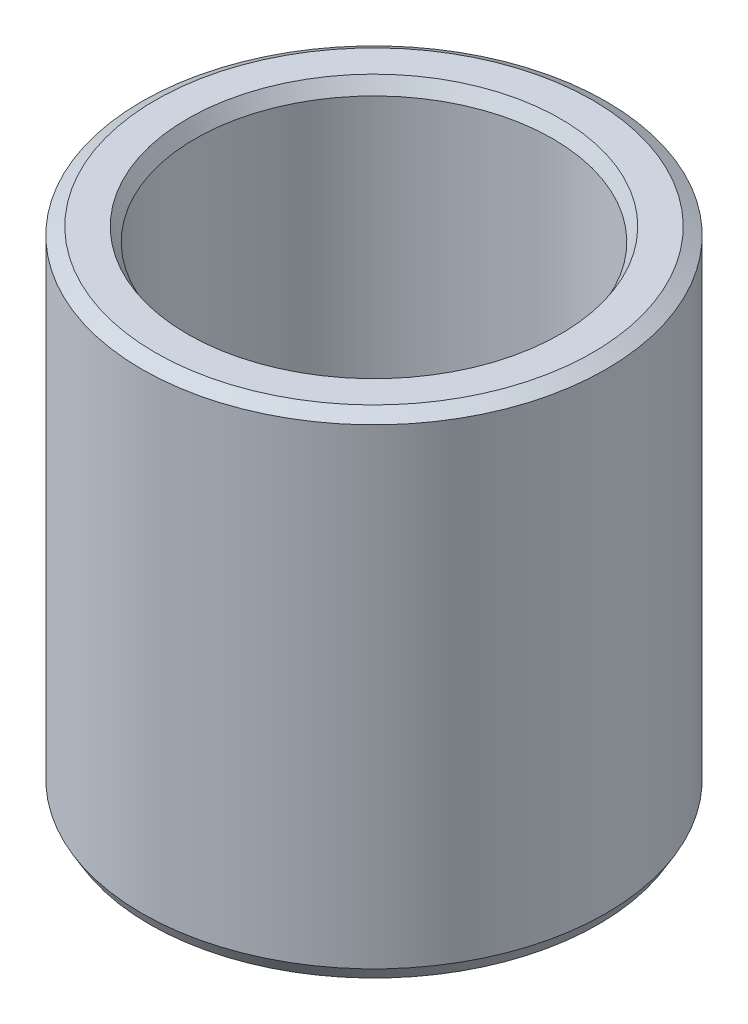
ISO-10303-21;
HEADER;
FILE_DESCRIPTION(('STEP AP214'),'2;1');
FILE_NAME('part.step','',(''),(''),'','','');
FILE_SCHEMA(('AUTOMOTIVE_DESIGN { 1 0 10303 214 1 1 1 1 }'));
ENDSEC;
DATA;
#1=APPLICATION_CONTEXT('core data for automotive mechanical design processes');
#2=APPLICATION_PROTOCOL_DEFINITION('international standard','automotive_design',2000,#1);
#3=PRODUCT_CONTEXT('',#1,'mechanical');
#4=PRODUCT('Part','Part','',(#3));
#5=PRODUCT_RELATED_PRODUCT_CATEGORY('part','',(#4));
#6=PRODUCT_DEFINITION_FORMATION('','',#4);
#7=PRODUCT_DEFINITION_CONTEXT('part definition',#1,'design');
#8=PRODUCT_DEFINITION('design','',#6,#7);
#9=PRODUCT_DEFINITION_SHAPE('','',#8);
#10=(LENGTH_UNIT() NAMED_UNIT(*) SI_UNIT(.MILLI.,.METRE.));
#11=(NAMED_UNIT(*) PLANE_ANGLE_UNIT() SI_UNIT($,.RADIAN.));
#12=(NAMED_UNIT(*) SI_UNIT($,.STERADIAN.) SOLID_ANGLE_UNIT());
#13=UNCERTAINTY_MEASURE_WITH_UNIT(LENGTH_MEASURE(1.E-05),#10,'distance_accuracy_value','');
#14=(GEOMETRIC_REPRESENTATION_CONTEXT(3) GLOBAL_UNCERTAINTY_ASSIGNED_CONTEXT((#13)) GLOBAL_UNIT_ASSIGNED_CONTEXT((#10,
#11,#12)) REPRESENTATION_CONTEXT('',''));
#15=CARTESIAN_POINT('',(0.,0.,0.));
#16=DIRECTION('',(0.,0.,1.));
#17=DIRECTION('',(1.,0.,0.));
#18=AXIS2_PLACEMENT_3D('',#15,#16,#17);
#19=CARTESIAN_POINT('',(0.,74.2502625635533,0.));
#20=DIRECTION('',(0.,-1.,0.));
#21=DIRECTION('',(0.,0.,-1.));
#22=AXIS2_PLACEMENT_3D('',#19,#20,#21);
#23=CYLINDRICAL_SURFACE('',#22,35.);
#24=CARTESIAN_POINT('',(0.,2.02294068629337,0.));
#25=DIRECTION('',(0.,1.,0.));
#26=DIRECTION('',(0.,0.,1.));
#27=AXIS2_PLACEMENT_3D('',#24,#25,#26);
#28=CIRCLE('',#27,35.);
#29=CARTESIAN_POINT('',(0.,2.02294068629337,35.));
#30=VERTEX_POINT('',#29);
#31=EDGE_CURVE('E10',#30,#30,#28,.T.);
#32=ORIENTED_EDGE('',*,*,#31,.T.);
#33=EDGE_LOOP('',(#32));
#34=FACE_BOUND('',#33,.T.);
#35=CARTESIAN_POINT('',(0.,73.0823172137672,0.));
#36=DIRECTION('',(0.,1.,0.));
#37=DIRECTION('',(0.,0.,1.));
#38=AXIS2_PLACEMENT_3D('',#35,#36,#37);
#39=CIRCLE('',#38,35.);
#40=CARTESIAN_POINT('',(0.,73.0823172137672,35.));
#41=VERTEX_POINT('',#40);
#42=EDGE_CURVE('E50',#41,#41,#39,.F.);
#43=ORIENTED_EDGE('',*,*,#42,.T.);
#44=EDGE_LOOP('',(#43));
#45=FACE_BOUND('',#44,.T.);
#46=ADVANCED_FACE('F39',(#34,#45),#23,.T.);
#47=CARTESIAN_POINT('',(0.,74.2502625635533,0.));
#48=DIRECTION('',(0.,1.,0.));
#49=DIRECTION('',(0.,0.,1.));
#50=AXIS2_PLACEMENT_3D('',#47,#48,#49);
#51=PLANE('',#50);
#52=CARTESIAN_POINT('',(0.,74.2502625635533,0.));
#53=DIRECTION('',(0.,1.,0.));
#54=DIRECTION('',(0.,0.,1.));
#55=AXIS2_PLACEMENT_3D('',#52,#53,#54);
#56=CIRCLE('',#55,28.1301728804745);
#57=CARTESIAN_POINT('',(0.,74.2502625635533,28.1301728804745));
#58=VERTEX_POINT('',#57);
#59=EDGE_CURVE('E58',#58,#58,#56,.F.);
#60=ORIENTED_EDGE('',*,*,#59,.T.);
#61=EDGE_LOOP('',(#60));
#62=FACE_BOUND('',#61,.T.);
#63=CARTESIAN_POINT('',(0.,74.2502625635533,0.));
#64=DIRECTION('',(0.,1.,0.));
#65=DIRECTION('',(0.,0.,1.));
#66=AXIS2_PLACEMENT_3D('',#63,#64,#65);
#67=CIRCLE('',#66,32.9770593137066);
#68=CARTESIAN_POINT('',(0.,74.2502625635533,32.9770593137066));
#69=VERTEX_POINT('',#68);
#70=EDGE_CURVE('E61',#69,#69,#67,.T.);
#71=ORIENTED_EDGE('',*,*,#70,.T.);
#72=EDGE_LOOP('',(#71));
#73=FACE_BOUND('',#72,.T.);
#74=ADVANCED_FACE('F88',(#62,#73),#51,.T.);
#75=CARTESIAN_POINT('',(0.,0.,0.));
#76=DIRECTION('',(0.,1.,0.));
#77=DIRECTION('',(0.,0.,1.));
#78=AXIS2_PLACEMENT_3D('',#75,#76,#77);
#79=PLANE('',#78);
#80=CARTESIAN_POINT('',(0.,0.,0.));
#81=DIRECTION('',(0.,1.,0.));
#82=DIRECTION('',(0.,0.,1.));
#83=AXIS2_PLACEMENT_3D('',#80,#81,#82);
#84=CIRCLE('',#83,28.9851682169818);
#85=CARTESIAN_POINT('',(0.,0.,28.9851682169818));
#86=VERTEX_POINT('',#85);
#87=EDGE_CURVE('E51',#86,#86,#84,.T.);
#88=ORIENTED_EDGE('',*,*,#87,.T.);
#89=EDGE_LOOP('',(#88));
#90=FACE_BOUND('',#89,.T.);
#91=CARTESIAN_POINT('',(0.,0.,0.));
#92=DIRECTION('',(0.,1.,0.));
#93=DIRECTION('',(0.,0.,1.));
#94=AXIS2_PLACEMENT_3D('',#91,#92,#93);
#95=CIRCLE('',#94,33.8320546502139);
#96=CARTESIAN_POINT('',(0.,0.,33.8320546502139));
#97=VERTEX_POINT('',#96);
#98=EDGE_CURVE('E54',#97,#97,#95,.F.);
#99=ORIENTED_EDGE('',*,*,#98,.T.);
#100=EDGE_LOOP('',(#99));
#101=FACE_BOUND('',#100,.T.);
#102=ADVANCED_FACE('F83',(#90,#101),#79,.F.);
#103=CARTESIAN_POINT('',(0.,74.2502625635533,0.));
#104=DIRECTION('',(0.,-1.,0.));
#105=DIRECTION('',(0.,0.,-1.));
#106=AXIS2_PLACEMENT_3D('',#103,#104,#105);
#107=CYLINDRICAL_SURFACE('',#106,26.9622275306884);
#108=CARTESIAN_POINT('',(0.,72.2273218772599,0.));
#109=DIRECTION('',(0.,1.,0.));
#110=DIRECTION('',(0.,0.,1.));
#111=AXIS2_PLACEMENT_3D('',#108,#109,#110);
#112=CIRCLE('',#111,26.9622275306884);
#113=CARTESIAN_POINT('',(0.,72.2273218772599,26.9622275306884));
#114=VERTEX_POINT('',#113);
#115=EDGE_CURVE('E67',#114,#114,#112,.T.);
#116=ORIENTED_EDGE('',*,*,#115,.T.);
#117=EDGE_LOOP('',(#116));
#118=FACE_BOUND('',#117,.T.);
#119=CARTESIAN_POINT('',(0.,1.16794534978615,0.));
#120=DIRECTION('',(0.,1.,0.));
#121=DIRECTION('',(0.,0.,1.));
#122=AXIS2_PLACEMENT_3D('',#119,#120,#121);
#123=CIRCLE('',#122,26.9622275306884);
#124=CARTESIAN_POINT('',(0.,1.16794534978615,26.9622275306884));
#125=VERTEX_POINT('',#124);
#126=EDGE_CURVE('E69',#125,#125,#123,.F.);
#127=ORIENTED_EDGE('',*,*,#126,.T.);
#128=EDGE_LOOP('',(#127));
#129=FACE_BOUND('',#128,.T.);
#130=ADVANCED_FACE('F71',(#118,#129),#107,.F.);
#131=CARTESIAN_POINT('',(0.,72.2273218772599,0.));
#132=DIRECTION('',(0.,1.,0.));
#133=DIRECTION('',(0.,0.,1.));
#134=AXIS2_PLACEMENT_3D('',#131,#132,#133);
#135=CONICAL_SURFACE('',#134,26.9622275306884,0.523598775598296);
#136=ORIENTED_EDGE('',*,*,#59,.F.);
#137=EDGE_LOOP('',(#136));
#138=FACE_BOUND('',#137,.T.);
#139=ORIENTED_EDGE('',*,*,#115,.F.);
#140=EDGE_LOOP('',(#139));
#141=FACE_BOUND('',#140,.T.);
#142=ADVANCED_FACE('F77',(#138,#141),#135,.F.);
#143=CARTESIAN_POINT('',(0.,0.,0.));
#144=DIRECTION('',(0.,-1.,0.));
#145=DIRECTION('',(0.,0.,-1.));
#146=AXIS2_PLACEMENT_3D('',#143,#144,#145);
#147=CONICAL_SURFACE('',#146,28.9851682169818,1.0471975511966);
#148=ORIENTED_EDGE('',*,*,#126,.F.);
#149=EDGE_LOOP('',(#148));
#150=FACE_BOUND('',#149,.T.);
#151=ORIENTED_EDGE('',*,*,#87,.F.);
#152=EDGE_LOOP('',(#151));
#153=FACE_BOUND('',#152,.T.);
#154=ADVANCED_FACE('F73',(#150,#153),#147,.F.);
#155=CARTESIAN_POINT('',(0.,2.02294068629337,0.));
#156=DIRECTION('',(0.,1.,0.));
#157=DIRECTION('',(0.,0.,1.));
#158=AXIS2_PLACEMENT_3D('',#155,#156,#157);
#159=CONICAL_SURFACE('',#158,35.,0.523598775598303);
#160=ORIENTED_EDGE('',*,*,#98,.F.);
#161=EDGE_LOOP('',(#160));
#162=FACE_BOUND('',#161,.T.);
#163=ORIENTED_EDGE('',*,*,#31,.F.);
#164=EDGE_LOOP('',(#163));
#165=FACE_BOUND('',#164,.T.);
#166=ADVANCED_FACE('F76',(#162,#165),#159,.T.);
#167=CARTESIAN_POINT('',(0.,74.2502625635533,0.));
#168=DIRECTION('',(0.,-1.,0.));
#169=DIRECTION('',(0.,0.,-1.));
#170=AXIS2_PLACEMENT_3D('',#167,#168,#169);
#171=CONICAL_SURFACE('',#170,32.9770593137066,1.0471975511966);
#172=ORIENTED_EDGE('',*,*,#42,.F.);
#173=EDGE_LOOP('',(#172));
#174=FACE_BOUND('',#173,.T.);
#175=ORIENTED_EDGE('',*,*,#70,.F.);
#176=EDGE_LOOP('',(#175));
#177=FACE_BOUND('',#176,.T.);
#178=ADVANCED_FACE('F45',(#174,#177),#171,.T.);
#179=CLOSED_SHELL('',(#46,#74,#102,#130,#142,#154,#166,#178));
#180=MANIFOLD_SOLID_BREP('B2',#179);
#181=ADVANCED_BREP_SHAPE_REPRESENTATION('',(#18,#180),#14);
#182=SHAPE_DEFINITION_REPRESENTATION(#9,#181);
ENDSEC;
END-ISO-10303-21;
